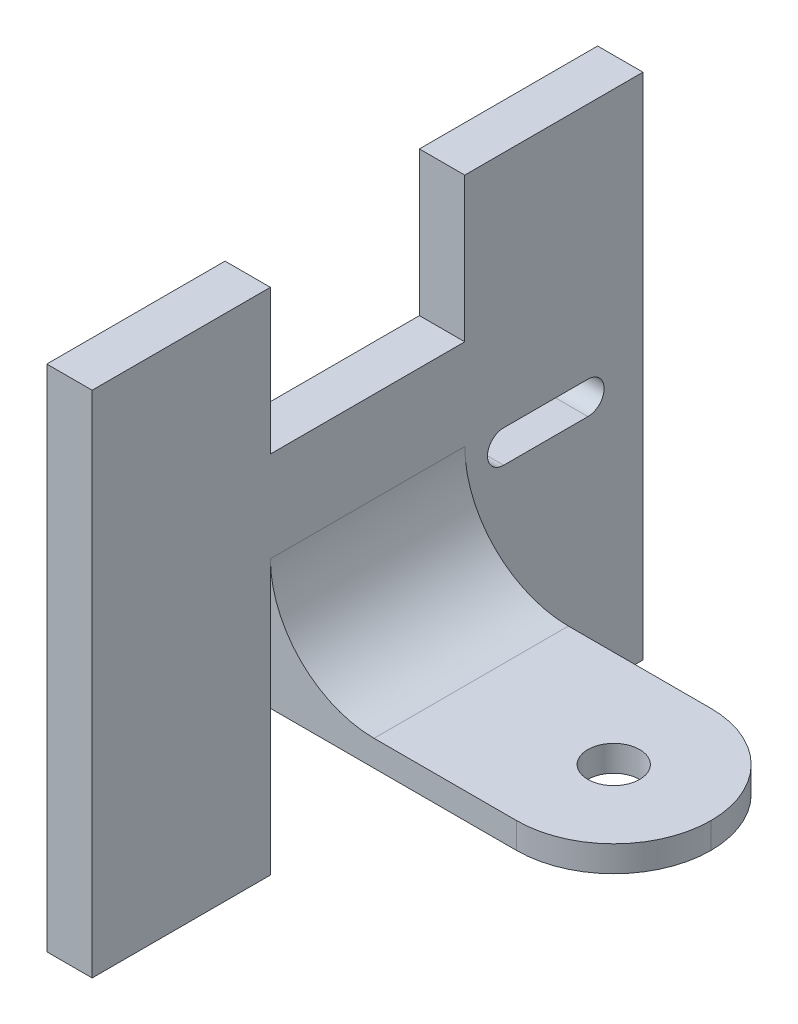
ISO-10303-21;
HEADER;
FILE_DESCRIPTION(('STEP AP214'),'2;1');
FILE_NAME('part.step','',(''),(''),'','','');
FILE_SCHEMA(('AUTOMOTIVE_DESIGN { 1 0 10303 214 1 1 1 1 }'));
ENDSEC;
DATA;
#1=APPLICATION_CONTEXT('core data for automotive mechanical design processes');
#2=APPLICATION_PROTOCOL_DEFINITION('international standard','automotive_design',2000,#1);
#3=PRODUCT_CONTEXT('',#1,'mechanical');
#4=PRODUCT('Part','Part','',(#3));
#5=PRODUCT_RELATED_PRODUCT_CATEGORY('part','',(#4));
#6=PRODUCT_DEFINITION_FORMATION('','',#4);
#7=PRODUCT_DEFINITION_CONTEXT('part definition',#1,'design');
#8=PRODUCT_DEFINITION('design','',#6,#7);
#9=PRODUCT_DEFINITION_SHAPE('','',#8);
#10=(LENGTH_UNIT() NAMED_UNIT(*) SI_UNIT(.MILLI.,.METRE.));
#11=(NAMED_UNIT(*) PLANE_ANGLE_UNIT() SI_UNIT($,.RADIAN.));
#12=(NAMED_UNIT(*) SI_UNIT($,.STERADIAN.) SOLID_ANGLE_UNIT());
#13=UNCERTAINTY_MEASURE_WITH_UNIT(LENGTH_MEASURE(1.E-05),#10,'distance_accuracy_value','');
#14=(GEOMETRIC_REPRESENTATION_CONTEXT(3) GLOBAL_UNCERTAINTY_ASSIGNED_CONTEXT((#13)) GLOBAL_UNIT_ASSIGNED_CONTEXT((#10,
#11,#12)) REPRESENTATION_CONTEXT('',''));
#15=CARTESIAN_POINT('',(0.,0.,0.));
#16=DIRECTION('',(0.,0.,1.));
#17=DIRECTION('',(1.,0.,0.));
#18=AXIS2_PLACEMENT_3D('',#15,#16,#17);
#19=CARTESIAN_POINT('',(-30.,4.,-15.));
#20=DIRECTION('',(0.,0.,1.));
#21=DIRECTION('',(1.,0.,0.));
#22=AXIS2_PLACEMENT_3D('',#19,#20,#21);
#23=PLANE('',#22);
#24=DIRECTION('',(-1.,0.,0.));
#25=VECTOR('',#24,1.);
#26=CARTESIAN_POINT('',(-30.,4.,-15.));
#27=LINE('',#26,#25);
#28=CARTESIAN_POINT('',(15.,4.,-15.));
#29=VERTEX_POINT('',#28);
#30=CARTESIAN_POINT('',(-7.00000000000004,4.,-15.));
#31=VERTEX_POINT('',#30);
#32=EDGE_CURVE('E304',#29,#31,#27,.T.);
#33=ORIENTED_EDGE('',*,*,#32,.F.);
#34=DIRECTION('',(0.,-1.,0.));
#35=VECTOR('',#34,1.);
#36=CARTESIAN_POINT('',(15.,4.,-15.));
#37=LINE('',#36,#35);
#38=CARTESIAN_POINT('',(15.,0.,-15.));
#39=VERTEX_POINT('',#38);
#40=EDGE_CURVE('E11',#29,#39,#37,.T.);
#41=ORIENTED_EDGE('',*,*,#40,.T.);
#42=DIRECTION('',(-1.,0.,0.));
#43=VECTOR('',#42,1.);
#44=CARTESIAN_POINT('',(-30.,0.,-15.));
#45=LINE('',#44,#43);
#46=CARTESIAN_POINT('',(-23.,0.,-15.));
#47=VERTEX_POINT('',#46);
#48=EDGE_CURVE('E309',#39,#47,#45,.T.);
#49=ORIENTED_EDGE('',*,*,#48,.T.);
#50=DIRECTION('',(0.,-1.,0.));
#51=VECTOR('',#50,1.);
#52=CARTESIAN_POINT('',(-23.,-22.2864487732451,-15.));
#53=LINE('',#52,#51);
#54=CARTESIAN_POINT('',(-23.,20.,-15.));
#55=VERTEX_POINT('',#54);
#56=EDGE_CURVE('E274',#55,#47,#53,.T.);
#57=ORIENTED_EDGE('',*,*,#56,.F.);
#58=CARTESIAN_POINT('',(-7.00000000000004,20.,-15.));
#59=DIRECTION('',(0.,0.,1.));
#60=DIRECTION('',(1.,0.,0.));
#61=AXIS2_PLACEMENT_3D('',#58,#59,#60);
#62=CIRCLE('',#61,16.);
#63=EDGE_CURVE('E322',#55,#31,#62,.T.);
#64=ORIENTED_EDGE('',*,*,#63,.T.);
#65=EDGE_LOOP('',(#33,#41,#49,#57,#64));
#66=FACE_BOUND('',#65,.T.);
#67=ADVANCED_FACE('F35',(#66),#23,.F.);
#68=CARTESIAN_POINT('',(0.,4.,0.));
#69=DIRECTION('',(0.,-1.,0.));
#70=DIRECTION('',(0.,0.,-1.));
#71=AXIS2_PLACEMENT_3D('',#68,#69,#70);
#72=PLANE('',#71);
#73=CARTESIAN_POINT('',(15.,4.,0.));
#74=DIRECTION('',(0.,1.,0.));
#75=DIRECTION('',(0.,0.,1.));
#76=AXIS2_PLACEMENT_3D('',#73,#74,#75);
#77=CIRCLE('',#76,4.);
#78=CARTESIAN_POINT('',(15.,4.,4.));
#79=VERTEX_POINT('',#78);
#80=EDGE_CURVE('E298',#79,#79,#77,.T.);
#81=ORIENTED_EDGE('',*,*,#80,.F.);
#82=EDGE_LOOP('',(#81));
#83=FACE_BOUND('',#82,.T.);
#84=DIRECTION('',(1.,0.,0.));
#85=VECTOR('',#84,1.);
#86=CARTESIAN_POINT('',(-30.,4.,15.));
#87=LINE('',#86,#85);
#88=CARTESIAN_POINT('',(-7.00000000000004,4.,15.));
#89=VERTEX_POINT('',#88);
#90=CARTESIAN_POINT('',(15.,4.,15.));
#91=VERTEX_POINT('',#90);
#92=EDGE_CURVE('E306',#89,#91,#87,.T.);
#93=ORIENTED_EDGE('',*,*,#92,.T.);
#94=CARTESIAN_POINT('',(15.,4.,0.));
#95=DIRECTION('',(0.,-1.,0.));
#96=DIRECTION('',(0.,0.,-1.));
#97=AXIS2_PLACEMENT_3D('',#94,#95,#96);
#98=CIRCLE('',#97,15.);
#99=CARTESIAN_POINT('',(30.,4.,0.));
#100=VERTEX_POINT('',#99);
#101=EDGE_CURVE('E44',#91,#100,#98,.F.);
#102=ORIENTED_EDGE('',*,*,#101,.T.);
#103=CARTESIAN_POINT('',(15.,4.,0.));
#104=DIRECTION('',(0.,-1.,0.));
#105=DIRECTION('',(0.,0.,-1.));
#106=AXIS2_PLACEMENT_3D('',#103,#104,#105);
#107=CIRCLE('',#106,15.);
#108=EDGE_CURVE('E54',#100,#29,#107,.F.);
#109=ORIENTED_EDGE('',*,*,#108,.T.);
#110=ORIENTED_EDGE('',*,*,#32,.T.);
#111=DIRECTION('',(0.,0.,-1.));
#112=VECTOR('',#111,1.);
#113=CARTESIAN_POINT('',(-7.00000000000004,4.,15.));
#114=LINE('',#113,#112);
#115=EDGE_CURVE('E320',#31,#89,#114,.F.);
#116=ORIENTED_EDGE('',*,*,#115,.T.);
#117=EDGE_LOOP('',(#93,#102,#109,#110,#116));
#118=FACE_BOUND('',#117,.T.);
#119=ADVANCED_FACE('F346',(#83,#118),#72,.F.);
#120=CARTESIAN_POINT('',(0.,0.,0.));
#121=DIRECTION('',(0.,-1.,0.));
#122=DIRECTION('',(0.,0.,-1.));
#123=AXIS2_PLACEMENT_3D('',#120,#121,#122);
#124=PLANE('',#123);
#125=CARTESIAN_POINT('',(15.,0.,0.));
#126=DIRECTION('',(0.,-1.,0.));
#127=DIRECTION('',(0.,0.,-1.));
#128=AXIS2_PLACEMENT_3D('',#125,#126,#127);
#129=CIRCLE('',#128,15.);
#130=CARTESIAN_POINT('',(30.,0.,0.));
#131=VERTEX_POINT('',#130);
#132=EDGE_CURVE('E328',#39,#131,#129,.T.);
#133=ORIENTED_EDGE('',*,*,#132,.T.);
#134=CARTESIAN_POINT('',(15.,0.,0.));
#135=DIRECTION('',(0.,-1.,0.));
#136=DIRECTION('',(0.,0.,-1.));
#137=AXIS2_PLACEMENT_3D('',#134,#135,#136);
#138=CIRCLE('',#137,15.);
#139=CARTESIAN_POINT('',(15.,0.,15.));
#140=VERTEX_POINT('',#139);
#141=EDGE_CURVE('E330',#131,#140,#138,.T.);
#142=ORIENTED_EDGE('',*,*,#141,.T.);
#143=DIRECTION('',(1.,0.,0.));
#144=VECTOR('',#143,1.);
#145=CARTESIAN_POINT('',(-30.,0.,15.));
#146=LINE('',#145,#144);
#147=CARTESIAN_POINT('',(-23.,0.,15.));
#148=VERTEX_POINT('',#147);
#149=EDGE_CURVE('E314',#148,#140,#146,.T.);
#150=ORIENTED_EDGE('',*,*,#149,.F.);
#151=CARTESIAN_POINT('',(-30.,0.,15.));
#152=VERTEX_POINT('',#151);
#153=EDGE_CURVE('E307',#152,#148,#146,.T.);
#154=ORIENTED_EDGE('',*,*,#153,.F.);
#155=DIRECTION('',(0.,0.,1.));
#156=VECTOR('',#155,1.);
#157=CARTESIAN_POINT('',(-30.,0.,15.));
#158=LINE('',#157,#156);
#159=CARTESIAN_POINT('',(-30.,0.,-15.));
#160=VERTEX_POINT('',#159);
#161=EDGE_CURVE('E311',#160,#152,#158,.T.);
#162=ORIENTED_EDGE('',*,*,#161,.F.);
#163=EDGE_CURVE('E301',#47,#160,#45,.T.);
#164=ORIENTED_EDGE('',*,*,#163,.F.);
#165=ORIENTED_EDGE('',*,*,#48,.F.);
#166=EDGE_LOOP('',(#133,#142,#150,#154,#162,#164,#165));
#167=FACE_BOUND('',#166,.T.);
#168=CARTESIAN_POINT('',(15.,0.,0.));
#169=DIRECTION('',(0.,1.,0.));
#170=DIRECTION('',(0.,0.,1.));
#171=AXIS2_PLACEMENT_3D('',#168,#169,#170);
#172=CIRCLE('',#171,4.);
#173=CARTESIAN_POINT('',(15.,0.,4.));
#174=VERTEX_POINT('',#173);
#175=EDGE_CURVE('E297',#174,#174,#172,.T.);
#176=ORIENTED_EDGE('',*,*,#175,.T.);
#177=EDGE_LOOP('',(#176));
#178=FACE_BOUND('',#177,.T.);
#179=ADVANCED_FACE('F355',(#167,#178),#124,.T.);
#180=CARTESIAN_POINT('',(-30.,4.,15.));
#181=DIRECTION('',(1.,0.,0.));
#182=DIRECTION('',(0.,0.,-1.));
#183=AXIS2_PLACEMENT_3D('',#180,#181,#182);
#184=PLANE('',#183);
#185=DIRECTION('',(0.,0.,1.));
#186=VECTOR('',#185,1.);
#187=CARTESIAN_POINT('',(-30.,19.5,-21.01));
#188=LINE('',#187,#186);
#189=CARTESIAN_POINT('',(-30.,19.5,-34.01));
#190=VERTEX_POINT('',#189);
#191=CARTESIAN_POINT('',(-30.,19.5,-21.01));
#192=VERTEX_POINT('',#191);
#193=EDGE_CURVE('E187',#190,#192,#188,.T.);
#194=ORIENTED_EDGE('',*,*,#193,.T.);
#195=CARTESIAN_POINT('',(-30.,17.,-21.01));
#196=DIRECTION('',(1.,0.,0.));
#197=DIRECTION('',(0.,0.,-1.));
#198=AXIS2_PLACEMENT_3D('',#195,#196,#197);
#199=CIRCLE('',#198,2.5);
#200=CARTESIAN_POINT('',(-30.,14.5,-21.01));
#201=VERTEX_POINT('',#200);
#202=EDGE_CURVE('E179',#192,#201,#199,.T.);
#203=ORIENTED_EDGE('',*,*,#202,.T.);
#204=DIRECTION('',(0.,0.,-1.));
#205=VECTOR('',#204,1.);
#206=CARTESIAN_POINT('',(-30.,14.5,-21.01));
#207=LINE('',#206,#205);
#208=CARTESIAN_POINT('',(-30.,14.5,-34.01));
#209=VERTEX_POINT('',#208);
#210=EDGE_CURVE('E191',#201,#209,#207,.T.);
#211=ORIENTED_EDGE('',*,*,#210,.T.);
#212=CARTESIAN_POINT('',(-30.,17.,-34.01));
#213=DIRECTION('',(1.,0.,0.));
#214=DIRECTION('',(0.,0.,-1.));
#215=AXIS2_PLACEMENT_3D('',#212,#213,#214);
#216=CIRCLE('',#215,2.5);
#217=EDGE_CURVE('E195',#209,#190,#216,.T.);
#218=ORIENTED_EDGE('',*,*,#217,.T.);
#219=EDGE_LOOP('',(#194,#203,#211,#218));
#220=FACE_BOUND('',#219,.T.);
#221=ORIENTED_EDGE('',*,*,#161,.T.);
#222=DIRECTION('',(0.,1.,0.));
#223=VECTOR('',#222,1.);
#224=CARTESIAN_POINT('',(-30.,-22.2864487732451,15.));
#225=LINE('',#224,#223);
#226=CARTESIAN_POINT('',(-30.,-22.2864487732451,15.));
#227=VERTEX_POINT('',#226);
#228=EDGE_CURVE('E233',#227,#152,#225,.T.);
#229=ORIENTED_EDGE('',*,*,#228,.F.);
#230=DIRECTION('',(0.,0.,-1.));
#231=VECTOR('',#230,1.);
#232=CARTESIAN_POINT('',(-30.,-22.2864487732451,42.51));
#233=LINE('',#232,#231);
#234=CARTESIAN_POINT('',(-30.,-22.2864487732451,42.51));
#235=VERTEX_POINT('',#234);
#236=EDGE_CURVE('E251',#235,#227,#233,.T.);
#237=ORIENTED_EDGE('',*,*,#236,.F.);
#238=DIRECTION('',(0.,1.,0.));
#239=VECTOR('',#238,1.);
#240=CARTESIAN_POINT('',(-30.,-22.2864487732451,42.51));
#241=LINE('',#240,#239);
#242=CARTESIAN_POINT('',(-30.,56.2864487732451,42.51));
#243=VERTEX_POINT('',#242);
#244=EDGE_CURVE('E219',#235,#243,#241,.T.);
#245=ORIENTED_EDGE('',*,*,#244,.T.);
#246=DIRECTION('',(0.,0.,-1.));
#247=VECTOR('',#246,1.);
#248=CARTESIAN_POINT('',(-30.,56.2864487732451,42.51));
#249=LINE('',#248,#247);
#250=CARTESIAN_POINT('',(-30.,56.2864487732451,15.));
#251=VERTEX_POINT('',#250);
#252=EDGE_CURVE('E232',#243,#251,#249,.T.);
#253=ORIENTED_EDGE('',*,*,#252,.T.);
#254=CARTESIAN_POINT('',(-30.,34.,15.));
#255=VERTEX_POINT('',#254);
#256=EDGE_CURVE('E215',#255,#251,#225,.T.);
#257=ORIENTED_EDGE('',*,*,#256,.F.);
#258=DIRECTION('',(0.,0.,1.));
#259=VECTOR('',#258,1.);
#260=CARTESIAN_POINT('',(-30.,34.,-15.));
#261=LINE('',#260,#259);
#262=CARTESIAN_POINT('',(-30.,34.,-15.));
#263=VERTEX_POINT('',#262);
#264=EDGE_CURVE('E287',#263,#255,#261,.T.);
#265=ORIENTED_EDGE('',*,*,#264,.F.);
#266=DIRECTION('',(0.,1.,0.));
#267=VECTOR('',#266,1.);
#268=CARTESIAN_POINT('',(-30.,-22.2864487732451,-15.));
#269=LINE('',#268,#267);
#270=CARTESIAN_POINT('',(-30.,56.2864487732451,-15.));
#271=VERTEX_POINT('',#270);
#272=EDGE_CURVE('E253',#263,#271,#269,.T.);
#273=ORIENTED_EDGE('',*,*,#272,.T.);
#274=DIRECTION('',(0.,0.,1.));
#275=VECTOR('',#274,1.);
#276=CARTESIAN_POINT('',(-30.,56.2864487732451,-42.51));
#277=LINE('',#276,#275);
#278=CARTESIAN_POINT('',(-30.,56.2864487732451,-42.51));
#279=VERTEX_POINT('',#278);
#280=EDGE_CURVE('E284',#279,#271,#277,.T.);
#281=ORIENTED_EDGE('',*,*,#280,.F.);
#282=DIRECTION('',(0.,1.,0.));
#283=VECTOR('',#282,1.);
#284=CARTESIAN_POINT('',(-30.,-22.2864487732451,-42.51));
#285=LINE('',#284,#283);
#286=CARTESIAN_POINT('',(-30.,-22.2864487732451,-42.51));
#287=VERTEX_POINT('',#286);
#288=EDGE_CURVE('E254',#287,#279,#285,.T.);
#289=ORIENTED_EDGE('',*,*,#288,.F.);
#290=DIRECTION('',(0.,0.,1.));
#291=VECTOR('',#290,1.);
#292=CARTESIAN_POINT('',(-30.,-22.2864487732451,-42.51));
#293=LINE('',#292,#291);
#294=CARTESIAN_POINT('',(-30.,-22.2864487732451,-15.));
#295=VERTEX_POINT('',#294);
#296=EDGE_CURVE('E264',#287,#295,#293,.T.);
#297=ORIENTED_EDGE('',*,*,#296,.T.);
#298=EDGE_CURVE('E265',#295,#160,#269,.T.);
#299=ORIENTED_EDGE('',*,*,#298,.T.);
#300=EDGE_LOOP('',(#221,#229,#237,#245,#253,#257,#265,#273,#281,#289,#297,#299));
#301=FACE_BOUND('',#300,.T.);
#302=ADVANCED_FACE('F197',(#220,#301),#184,.F.);
#303=CARTESIAN_POINT('',(-30.,4.,15.));
#304=DIRECTION('',(0.,0.,-1.));
#305=DIRECTION('',(-1.,0.,0.));
#306=AXIS2_PLACEMENT_3D('',#303,#304,#305);
#307=PLANE('',#306);
#308=ORIENTED_EDGE('',*,*,#149,.T.);
#309=DIRECTION('',(0.,-1.,0.));
#310=VECTOR('',#309,1.);
#311=CARTESIAN_POINT('',(15.,4.,15.));
#312=LINE('',#311,#310);
#313=EDGE_CURVE('E332',#140,#91,#312,.F.);
#314=ORIENTED_EDGE('',*,*,#313,.T.);
#315=ORIENTED_EDGE('',*,*,#92,.F.);
#316=CARTESIAN_POINT('',(-7.00000000000004,20.,15.));
#317=DIRECTION('',(0.,0.,-1.));
#318=DIRECTION('',(-1.,0.,0.));
#319=AXIS2_PLACEMENT_3D('',#316,#317,#318);
#320=CIRCLE('',#319,16.);
#321=CARTESIAN_POINT('',(-23.,19.9999999999999,15.));
#322=VERTEX_POINT('',#321);
#323=EDGE_CURVE('E325',#89,#322,#320,.T.);
#324=ORIENTED_EDGE('',*,*,#323,.T.);
#325=DIRECTION('',(0.,-1.,0.));
#326=VECTOR('',#325,1.);
#327=CARTESIAN_POINT('',(-23.,-22.2864487732451,15.));
#328=LINE('',#327,#326);
#329=EDGE_CURVE('E241',#322,#148,#328,.T.);
#330=ORIENTED_EDGE('',*,*,#329,.T.);
#331=EDGE_LOOP('',(#308,#314,#315,#324,#330));
#332=FACE_BOUND('',#331,.T.);
#333=ADVANCED_FACE('F340',(#332),#307,.F.);
#334=CARTESIAN_POINT('',(15.,4.,0.));
#335=DIRECTION('',(0.,-1.,0.));
#336=DIRECTION('',(0.,0.,-1.));
#337=AXIS2_PLACEMENT_3D('',#334,#335,#336);
#338=CYLINDRICAL_SURFACE('',#337,4.);
#339=ORIENTED_EDGE('',*,*,#80,.T.);
#340=EDGE_LOOP('',(#339));
#341=FACE_BOUND('',#340,.T.);
#342=ORIENTED_EDGE('',*,*,#175,.F.);
#343=EDGE_LOOP('',(#342));
#344=FACE_BOUND('',#343,.T.);
#345=ADVANCED_FACE('F377',(#341,#344),#338,.F.);
#346=CARTESIAN_POINT('',(-23.,34.,-15.));
#347=DIRECTION('',(-1.,0.,0.));
#348=DIRECTION('',(0.,0.,1.));
#349=AXIS2_PLACEMENT_3D('',#346,#347,#348);
#350=PLANE('',#349);
#351=DIRECTION('',(0.,0.,-1.));
#352=VECTOR('',#351,1.);
#353=CARTESIAN_POINT('',(-23.,14.5,-21.01));
#354=LINE('',#353,#352);
#355=CARTESIAN_POINT('',(-23.,14.5,-21.01));
#356=VERTEX_POINT('',#355);
#357=CARTESIAN_POINT('',(-23.,14.5,-34.01));
#358=VERTEX_POINT('',#357);
#359=EDGE_CURVE('E209',#356,#358,#354,.T.);
#360=ORIENTED_EDGE('',*,*,#359,.F.);
#361=CARTESIAN_POINT('',(-23.,17.,-21.01));
#362=DIRECTION('',(1.,0.,0.));
#363=DIRECTION('',(0.,0.,-1.));
#364=AXIS2_PLACEMENT_3D('',#361,#362,#363);
#365=CIRCLE('',#364,2.5);
#366=CARTESIAN_POINT('',(-23.,19.5,-21.01));
#367=VERTEX_POINT('',#366);
#368=EDGE_CURVE('E182',#367,#356,#365,.T.);
#369=ORIENTED_EDGE('',*,*,#368,.F.);
#370=DIRECTION('',(0.,0.,1.));
#371=VECTOR('',#370,1.);
#372=CARTESIAN_POINT('',(-23.,19.5,-21.01));
#373=LINE('',#372,#371);
#374=CARTESIAN_POINT('',(-23.,19.5,-34.01));
#375=VERTEX_POINT('',#374);
#376=EDGE_CURVE('E200',#375,#367,#373,.T.);
#377=ORIENTED_EDGE('',*,*,#376,.F.);
#378=CARTESIAN_POINT('',(-23.,17.,-34.01));
#379=DIRECTION('',(1.,0.,0.));
#380=DIRECTION('',(0.,0.,-1.));
#381=AXIS2_PLACEMENT_3D('',#378,#379,#380);
#382=CIRCLE('',#381,2.5);
#383=EDGE_CURVE('E203',#358,#375,#382,.T.);
#384=ORIENTED_EDGE('',*,*,#383,.F.);
#385=EDGE_LOOP('',(#360,#369,#377,#384));
#386=FACE_BOUND('',#385,.T.);
#387=DIRECTION('',(0.,0.,-1.));
#388=VECTOR('',#387,1.);
#389=CARTESIAN_POINT('',(-23.,20.,-15.));
#390=LINE('',#389,#388);
#391=EDGE_CURVE('E317',#322,#55,#390,.T.);
#392=ORIENTED_EDGE('',*,*,#391,.T.);
#393=ORIENTED_EDGE('',*,*,#56,.T.);
#394=CARTESIAN_POINT('',(-23.,-22.2864487732451,-15.));
#395=VERTEX_POINT('',#394);
#396=EDGE_CURVE('E270',#47,#395,#53,.T.);
#397=ORIENTED_EDGE('',*,*,#396,.T.);
#398=DIRECTION('',(0.,0.,1.));
#399=VECTOR('',#398,1.);
#400=CARTESIAN_POINT('',(-23.,-22.2864487732451,-42.51));
#401=LINE('',#400,#399);
#402=CARTESIAN_POINT('',(-23.,-22.2864487732451,-42.51));
#403=VERTEX_POINT('',#402);
#404=EDGE_CURVE('E278',#403,#395,#401,.T.);
#405=ORIENTED_EDGE('',*,*,#404,.F.);
#406=DIRECTION('',(0.,-1.,0.));
#407=VECTOR('',#406,1.);
#408=CARTESIAN_POINT('',(-23.,-22.2864487732451,-42.51));
#409=LINE('',#408,#407);
#410=CARTESIAN_POINT('',(-23.,56.2864487732451,-42.51));
#411=VERTEX_POINT('',#410);
#412=EDGE_CURVE('E260',#411,#403,#409,.T.);
#413=ORIENTED_EDGE('',*,*,#412,.F.);
#414=DIRECTION('',(0.,0.,1.));
#415=VECTOR('',#414,1.);
#416=CARTESIAN_POINT('',(-23.,56.2864487732451,-42.51));
#417=LINE('',#416,#415);
#418=CARTESIAN_POINT('',(-23.,56.2864487732451,-15.));
#419=VERTEX_POINT('',#418);
#420=EDGE_CURVE('E281',#411,#419,#417,.T.);
#421=ORIENTED_EDGE('',*,*,#420,.T.);
#422=CARTESIAN_POINT('',(-23.,34.,-15.));
#423=VERTEX_POINT('',#422);
#424=EDGE_CURVE('E271',#419,#423,#53,.T.);
#425=ORIENTED_EDGE('',*,*,#424,.T.);
#426=DIRECTION('',(0.,0.,-1.));
#427=VECTOR('',#426,1.);
#428=CARTESIAN_POINT('',(-23.,34.,-15.));
#429=LINE('',#428,#427);
#430=CARTESIAN_POINT('',(-23.,34.,15.));
#431=VERTEX_POINT('',#430);
#432=EDGE_CURVE('E293',#431,#423,#429,.T.);
#433=ORIENTED_EDGE('',*,*,#432,.F.);
#434=CARTESIAN_POINT('',(-23.,56.2864487732451,15.));
#435=VERTEX_POINT('',#434);
#436=EDGE_CURVE('E239',#435,#431,#328,.T.);
#437=ORIENTED_EDGE('',*,*,#436,.F.);
#438=DIRECTION('',(0.,0.,-1.));
#439=VECTOR('',#438,1.);
#440=CARTESIAN_POINT('',(-23.,56.2864487732451,42.51));
#441=LINE('',#440,#439);
#442=CARTESIAN_POINT('',(-23.,56.2864487732451,42.51));
#443=VERTEX_POINT('',#442);
#444=EDGE_CURVE('E246',#443,#435,#441,.T.);
#445=ORIENTED_EDGE('',*,*,#444,.F.);
#446=DIRECTION('',(0.,-1.,0.));
#447=VECTOR('',#446,1.);
#448=CARTESIAN_POINT('',(-23.,-22.2864487732451,42.51));
#449=LINE('',#448,#447);
#450=CARTESIAN_POINT('',(-23.,-22.2864487732451,42.51));
#451=VERTEX_POINT('',#450);
#452=EDGE_CURVE('E226',#443,#451,#449,.T.);
#453=ORIENTED_EDGE('',*,*,#452,.T.);
#454=DIRECTION('',(0.,0.,-1.));
#455=VECTOR('',#454,1.);
#456=CARTESIAN_POINT('',(-23.,-22.2864487732451,42.51));
#457=LINE('',#456,#455);
#458=CARTESIAN_POINT('',(-23.,-22.2864487732451,15.));
#459=VERTEX_POINT('',#458);
#460=EDGE_CURVE('E248',#451,#459,#457,.T.);
#461=ORIENTED_EDGE('',*,*,#460,.T.);
#462=EDGE_CURVE('E238',#148,#459,#328,.T.);
#463=ORIENTED_EDGE('',*,*,#462,.F.);
#464=ORIENTED_EDGE('',*,*,#329,.F.);
#465=EDGE_LOOP('',(#392,#393,#397,#405,#413,#421,#425,#433,#437,#445,#453,#461,#463,#464));
#466=FACE_BOUND('',#465,.T.);
#467=ADVANCED_FACE('F374',(#386,#466),#350,.F.);
#468=CARTESIAN_POINT('',(0.,34.,0.));
#469=DIRECTION('',(0.,1.,0.));
#470=DIRECTION('',(0.,0.,1.));
#471=AXIS2_PLACEMENT_3D('',#468,#469,#470);
#472=PLANE('',#471);
#473=ORIENTED_EDGE('',*,*,#264,.T.);
#474=DIRECTION('',(1.,0.,0.));
#475=VECTOR('',#474,1.);
#476=CARTESIAN_POINT('',(-30.,34.,15.));
#477=LINE('',#476,#475);
#478=EDGE_CURVE('E290',#255,#431,#477,.T.);
#479=ORIENTED_EDGE('',*,*,#478,.T.);
#480=ORIENTED_EDGE('',*,*,#432,.T.);
#481=DIRECTION('',(-1.,0.,0.));
#482=VECTOR('',#481,1.);
#483=CARTESIAN_POINT('',(-30.,34.,-15.));
#484=LINE('',#483,#482);
#485=EDGE_CURVE('E295',#423,#263,#484,.T.);
#486=ORIENTED_EDGE('',*,*,#485,.T.);
#487=EDGE_LOOP('',(#473,#479,#480,#486));
#488=FACE_BOUND('',#487,.T.);
#489=ADVANCED_FACE('F376',(#488),#472,.T.);
#490=CARTESIAN_POINT('',(0.,0.,-15.));
#491=DIRECTION('',(0.,0.,1.));
#492=DIRECTION('',(1.,0.,0.));
#493=AXIS2_PLACEMENT_3D('',#490,#491,#492);
#494=PLANE('',#493);
#495=ORIENTED_EDGE('',*,*,#485,.F.);
#496=ORIENTED_EDGE('',*,*,#424,.F.);
#497=DIRECTION('',(1.,0.,0.));
#498=VECTOR('',#497,1.);
#499=CARTESIAN_POINT('',(-23.,56.2864487732451,-15.));
#500=LINE('',#499,#498);
#501=EDGE_CURVE('E268',#271,#419,#500,.T.);
#502=ORIENTED_EDGE('',*,*,#501,.F.);
#503=ORIENTED_EDGE('',*,*,#272,.F.);
#504=EDGE_LOOP('',(#495,#496,#502,#503));
#505=FACE_BOUND('',#504,.T.);
#506=ADVANCED_FACE('F384',(#505),#494,.T.);
#507=CARTESIAN_POINT('',(-23.,56.2864487732451,-42.51));
#508=DIRECTION('',(0.,-1.,0.));
#509=DIRECTION('',(0.,0.,-1.));
#510=AXIS2_PLACEMENT_3D('',#507,#508,#509);
#511=PLANE('',#510);
#512=ORIENTED_EDGE('',*,*,#501,.T.);
#513=ORIENTED_EDGE('',*,*,#420,.F.);
#514=DIRECTION('',(1.,0.,0.));
#515=VECTOR('',#514,1.);
#516=CARTESIAN_POINT('',(-23.,56.2864487732451,-42.51));
#517=LINE('',#516,#515);
#518=EDGE_CURVE('E257',#279,#411,#517,.T.);
#519=ORIENTED_EDGE('',*,*,#518,.F.);
#520=ORIENTED_EDGE('',*,*,#280,.T.);
#521=EDGE_LOOP('',(#512,#513,#519,#520));
#522=FACE_BOUND('',#521,.T.);
#523=ADVANCED_FACE('F445',(#522),#511,.F.);
#524=CARTESIAN_POINT('',(-23.,-22.2864487732451,-42.51));
#525=DIRECTION('',(0.,1.,0.));
#526=DIRECTION('',(0.,0.,1.));
#527=AXIS2_PLACEMENT_3D('',#524,#525,#526);
#528=PLANE('',#527);
#529=DIRECTION('',(-1.,0.,0.));
#530=VECTOR('',#529,1.);
#531=CARTESIAN_POINT('',(-23.,-22.2864487732451,-15.));
#532=LINE('',#531,#530);
#533=EDGE_CURVE('E258',#395,#295,#532,.T.);
#534=ORIENTED_EDGE('',*,*,#533,.T.);
#535=ORIENTED_EDGE('',*,*,#296,.F.);
#536=DIRECTION('',(-1.,0.,0.));
#537=VECTOR('',#536,1.);
#538=CARTESIAN_POINT('',(-23.,-22.2864487732451,-42.51));
#539=LINE('',#538,#537);
#540=EDGE_CURVE('E262',#403,#287,#539,.T.);
#541=ORIENTED_EDGE('',*,*,#540,.F.);
#542=ORIENTED_EDGE('',*,*,#404,.T.);
#543=EDGE_LOOP('',(#534,#535,#541,#542));
#544=FACE_BOUND('',#543,.T.);
#545=ADVANCED_FACE('F439',(#544),#528,.F.);
#546=CARTESIAN_POINT('',(0.,0.,-42.51));
#547=DIRECTION('',(0.,0.,1.));
#548=DIRECTION('',(1.,0.,0.));
#549=AXIS2_PLACEMENT_3D('',#546,#547,#548);
#550=PLANE('',#549);
#551=ORIENTED_EDGE('',*,*,#288,.T.);
#552=ORIENTED_EDGE('',*,*,#518,.T.);
#553=ORIENTED_EDGE('',*,*,#412,.T.);
#554=ORIENTED_EDGE('',*,*,#540,.T.);
#555=EDGE_LOOP('',(#551,#552,#553,#554));
#556=FACE_BOUND('',#555,.T.);
#557=ADVANCED_FACE('F436',(#556),#550,.F.);
#558=ORIENTED_EDGE('',*,*,#396,.F.);
#559=ORIENTED_EDGE('',*,*,#163,.T.);
#560=ORIENTED_EDGE('',*,*,#298,.F.);
#561=ORIENTED_EDGE('',*,*,#533,.F.);
#562=EDGE_LOOP('',(#558,#559,#560,#561));
#563=FACE_BOUND('',#562,.T.);
#564=ADVANCED_FACE('F372',(#563),#494,.T.);
#565=CARTESIAN_POINT('',(0.,0.,15.));
#566=DIRECTION('',(0.,0.,-1.));
#567=DIRECTION('',(1.,0.,0.));
#568=AXIS2_PLACEMENT_3D('',#565,#566,#567);
#569=PLANE('',#568);
#570=ORIENTED_EDGE('',*,*,#478,.F.);
#571=ORIENTED_EDGE('',*,*,#256,.T.);
#572=DIRECTION('',(1.,0.,0.));
#573=VECTOR('',#572,1.);
#574=CARTESIAN_POINT('',(-23.,56.2864487732451,15.));
#575=LINE('',#574,#573);
#576=EDGE_CURVE('E223',#251,#435,#575,.T.);
#577=ORIENTED_EDGE('',*,*,#576,.T.);
#578=ORIENTED_EDGE('',*,*,#436,.T.);
#579=EDGE_LOOP('',(#570,#571,#577,#578));
#580=FACE_BOUND('',#579,.T.);
#581=ADVANCED_FACE('F428',(#580),#569,.T.);
#582=CARTESIAN_POINT('',(-23.,-22.2864487732451,42.51));
#583=DIRECTION('',(0.,-1.,0.));
#584=DIRECTION('',(0.,0.,-1.));
#585=AXIS2_PLACEMENT_3D('',#582,#583,#584);
#586=PLANE('',#585);
#587=DIRECTION('',(-1.,0.,0.));
#588=VECTOR('',#587,1.);
#589=CARTESIAN_POINT('',(-23.,-22.2864487732451,15.));
#590=LINE('',#589,#588);
#591=EDGE_CURVE('E235',#459,#227,#590,.T.);
#592=ORIENTED_EDGE('',*,*,#591,.F.);
#593=ORIENTED_EDGE('',*,*,#460,.F.);
#594=DIRECTION('',(-1.,0.,0.));
#595=VECTOR('',#594,1.);
#596=CARTESIAN_POINT('',(-23.,-22.2864487732451,42.51));
#597=LINE('',#596,#595);
#598=EDGE_CURVE('E222',#451,#235,#597,.T.);
#599=ORIENTED_EDGE('',*,*,#598,.T.);
#600=ORIENTED_EDGE('',*,*,#236,.T.);
#601=EDGE_LOOP('',(#592,#593,#599,#600));
#602=FACE_BOUND('',#601,.T.);
#603=ADVANCED_FACE('F431',(#602),#586,.T.);
#604=CARTESIAN_POINT('',(-23.,56.2864487732451,42.51));
#605=DIRECTION('',(0.,1.,0.));
#606=DIRECTION('',(0.,0.,1.));
#607=AXIS2_PLACEMENT_3D('',#604,#605,#606);
#608=PLANE('',#607);
#609=ORIENTED_EDGE('',*,*,#576,.F.);
#610=ORIENTED_EDGE('',*,*,#252,.F.);
#611=DIRECTION('',(1.,0.,0.));
#612=VECTOR('',#611,1.);
#613=CARTESIAN_POINT('',(-23.,56.2864487732451,42.51));
#614=LINE('',#613,#612);
#615=EDGE_CURVE('E229',#243,#443,#614,.T.);
#616=ORIENTED_EDGE('',*,*,#615,.T.);
#617=ORIENTED_EDGE('',*,*,#444,.T.);
#618=EDGE_LOOP('',(#609,#610,#616,#617));
#619=FACE_BOUND('',#618,.T.);
#620=ADVANCED_FACE('F423',(#619),#608,.T.);
#621=CARTESIAN_POINT('',(0.,0.,42.51));
#622=DIRECTION('',(0.,0.,-1.));
#623=DIRECTION('',(1.,0.,0.));
#624=AXIS2_PLACEMENT_3D('',#621,#622,#623);
#625=PLANE('',#624);
#626=ORIENTED_EDGE('',*,*,#244,.F.);
#627=ORIENTED_EDGE('',*,*,#598,.F.);
#628=ORIENTED_EDGE('',*,*,#452,.F.);
#629=ORIENTED_EDGE('',*,*,#615,.F.);
#630=EDGE_LOOP('',(#626,#627,#628,#629));
#631=FACE_BOUND('',#630,.T.);
#632=ADVANCED_FACE('F420',(#631),#625,.F.);
#633=ORIENTED_EDGE('',*,*,#228,.T.);
#634=ORIENTED_EDGE('',*,*,#153,.T.);
#635=ORIENTED_EDGE('',*,*,#462,.T.);
#636=ORIENTED_EDGE('',*,*,#591,.T.);
#637=EDGE_LOOP('',(#633,#634,#635,#636));
#638=FACE_BOUND('',#637,.T.);
#639=ADVANCED_FACE('F400',(#638),#569,.T.);
#640=CARTESIAN_POINT('',(-7.00000000000004,20.,-15.));
#641=DIRECTION('',(0.,0.,1.));
#642=DIRECTION('',(1.,0.,0.));
#643=AXIS2_PLACEMENT_3D('',#640,#641,#642);
#644=CYLINDRICAL_SURFACE('',#643,16.);
#645=ORIENTED_EDGE('',*,*,#323,.F.);
#646=ORIENTED_EDGE('',*,*,#115,.F.);
#647=ORIENTED_EDGE('',*,*,#63,.F.);
#648=ORIENTED_EDGE('',*,*,#391,.F.);
#649=EDGE_LOOP('',(#645,#646,#647,#648));
#650=FACE_BOUND('',#649,.T.);
#651=ADVANCED_FACE('F350',(#650),#644,.F.);
#652=CARTESIAN_POINT('',(-30.,17.,-21.01));
#653=DIRECTION('',(1.,0.,0.));
#654=DIRECTION('',(0.,0.,-1.));
#655=AXIS2_PLACEMENT_3D('',#652,#653,#654);
#656=CYLINDRICAL_SURFACE('',#655,2.5);
#657=ORIENTED_EDGE('',*,*,#368,.T.);
#658=DIRECTION('',(1.,0.,0.));
#659=VECTOR('',#658,1.);
#660=CARTESIAN_POINT('',(-30.,14.5,-21.01));
#661=LINE('',#660,#659);
#662=EDGE_CURVE('E175',#201,#356,#661,.T.);
#663=ORIENTED_EDGE('',*,*,#662,.F.);
#664=ORIENTED_EDGE('',*,*,#202,.F.);
#665=DIRECTION('',(1.,0.,0.));
#666=VECTOR('',#665,1.);
#667=CARTESIAN_POINT('',(-30.,19.5,-21.01));
#668=LINE('',#667,#666);
#669=EDGE_CURVE('E213',#192,#367,#668,.T.);
#670=ORIENTED_EDGE('',*,*,#669,.T.);
#671=EDGE_LOOP('',(#657,#663,#664,#670));
#672=FACE_BOUND('',#671,.T.);
#673=ADVANCED_FACE('F177',(#672),#656,.F.);
#674=CARTESIAN_POINT('',(-30.,19.5,-21.01));
#675=DIRECTION('',(0.,1.,0.));
#676=DIRECTION('',(0.,0.,1.));
#677=AXIS2_PLACEMENT_3D('',#674,#675,#676);
#678=PLANE('',#677);
#679=ORIENTED_EDGE('',*,*,#376,.T.);
#680=ORIENTED_EDGE('',*,*,#669,.F.);
#681=ORIENTED_EDGE('',*,*,#193,.F.);
#682=DIRECTION('',(1.,0.,0.));
#683=VECTOR('',#682,1.);
#684=CARTESIAN_POINT('',(-30.,19.5,-34.01));
#685=LINE('',#684,#683);
#686=EDGE_CURVE('E216',#190,#375,#685,.T.);
#687=ORIENTED_EDGE('',*,*,#686,.T.);
#688=EDGE_LOOP('',(#679,#680,#681,#687));
#689=FACE_BOUND('',#688,.T.);
#690=ADVANCED_FACE('F413',(#689),#678,.F.);
#691=CARTESIAN_POINT('',(-30.,17.,-34.01));
#692=DIRECTION('',(1.,0.,0.));
#693=DIRECTION('',(0.,0.,-1.));
#694=AXIS2_PLACEMENT_3D('',#691,#692,#693);
#695=CYLINDRICAL_SURFACE('',#694,2.5);
#696=ORIENTED_EDGE('',*,*,#383,.T.);
#697=ORIENTED_EDGE('',*,*,#686,.F.);
#698=ORIENTED_EDGE('',*,*,#217,.F.);
#699=DIRECTION('',(1.,0.,0.));
#700=VECTOR('',#699,1.);
#701=CARTESIAN_POINT('',(-30.,14.5,-34.01));
#702=LINE('',#701,#700);
#703=EDGE_CURVE('E186',#209,#358,#702,.T.);
#704=ORIENTED_EDGE('',*,*,#703,.T.);
#705=EDGE_LOOP('',(#696,#697,#698,#704));
#706=FACE_BOUND('',#705,.T.);
#707=ADVANCED_FACE('F408',(#706),#695,.F.);
#708=CARTESIAN_POINT('',(-30.,14.5,-21.01));
#709=DIRECTION('',(0.,-1.,0.));
#710=DIRECTION('',(0.,0.,-1.));
#711=AXIS2_PLACEMENT_3D('',#708,#709,#710);
#712=PLANE('',#711);
#713=ORIENTED_EDGE('',*,*,#359,.T.);
#714=ORIENTED_EDGE('',*,*,#703,.F.);
#715=ORIENTED_EDGE('',*,*,#210,.F.);
#716=ORIENTED_EDGE('',*,*,#662,.T.);
#717=EDGE_LOOP('',(#713,#714,#715,#716));
#718=FACE_BOUND('',#717,.T.);
#719=ADVANCED_FACE('F192',(#718),#712,.F.);
#720=CARTESIAN_POINT('',(15.,4.,0.));
#721=DIRECTION('',(0.,-1.,0.));
#722=DIRECTION('',(0.,0.,-1.));
#723=AXIS2_PLACEMENT_3D('',#720,#721,#722);
#724=CYLINDRICAL_SURFACE('',#723,15.);
#725=ORIENTED_EDGE('',*,*,#40,.F.);
#726=ORIENTED_EDGE('',*,*,#108,.F.);
#727=DIRECTION('',(0.,-1.,0.));
#728=VECTOR('',#727,1.);
#729=CARTESIAN_POINT('',(30.,4.,0.));
#730=LINE('',#729,#728);
#731=EDGE_CURVE('E39',#131,#100,#730,.F.);
#732=ORIENTED_EDGE('',*,*,#731,.F.);
#733=ORIENTED_EDGE('',*,*,#132,.F.);
#734=EDGE_LOOP('',(#725,#726,#732,#733));
#735=FACE_BOUND('',#734,.T.);
#736=ADVANCED_FACE('F37',(#735),#724,.T.);
#737=CARTESIAN_POINT('',(15.,4.,0.));
#738=DIRECTION('',(0.,-1.,0.));
#739=DIRECTION('',(0.,0.,-1.));
#740=AXIS2_PLACEMENT_3D('',#737,#738,#739);
#741=CYLINDRICAL_SURFACE('',#740,15.);
#742=ORIENTED_EDGE('',*,*,#101,.F.);
#743=ORIENTED_EDGE('',*,*,#313,.F.);
#744=ORIENTED_EDGE('',*,*,#141,.F.);
#745=ORIENTED_EDGE('',*,*,#731,.T.);
#746=EDGE_LOOP('',(#742,#743,#744,#745));
#747=FACE_BOUND('',#746,.T.);
#748=ADVANCED_FACE('F361',(#747),#741,.T.);
#749=CLOSED_SHELL('',(#67,#119,#179,#302,#333,#345,#467,#489,#506,#523,#545,#557,#564,#581,#603,
#620,#632,#639,#651,#673,#690,#707,#719,#736,#748));
#750=MANIFOLD_SOLID_BREP('B2',#749);
#751=ADVANCED_BREP_SHAPE_REPRESENTATION('',(#18,#750),#14);
#752=SHAPE_DEFINITION_REPRESENTATION(#9,#751);
ENDSEC;
END-ISO-10303-21;
